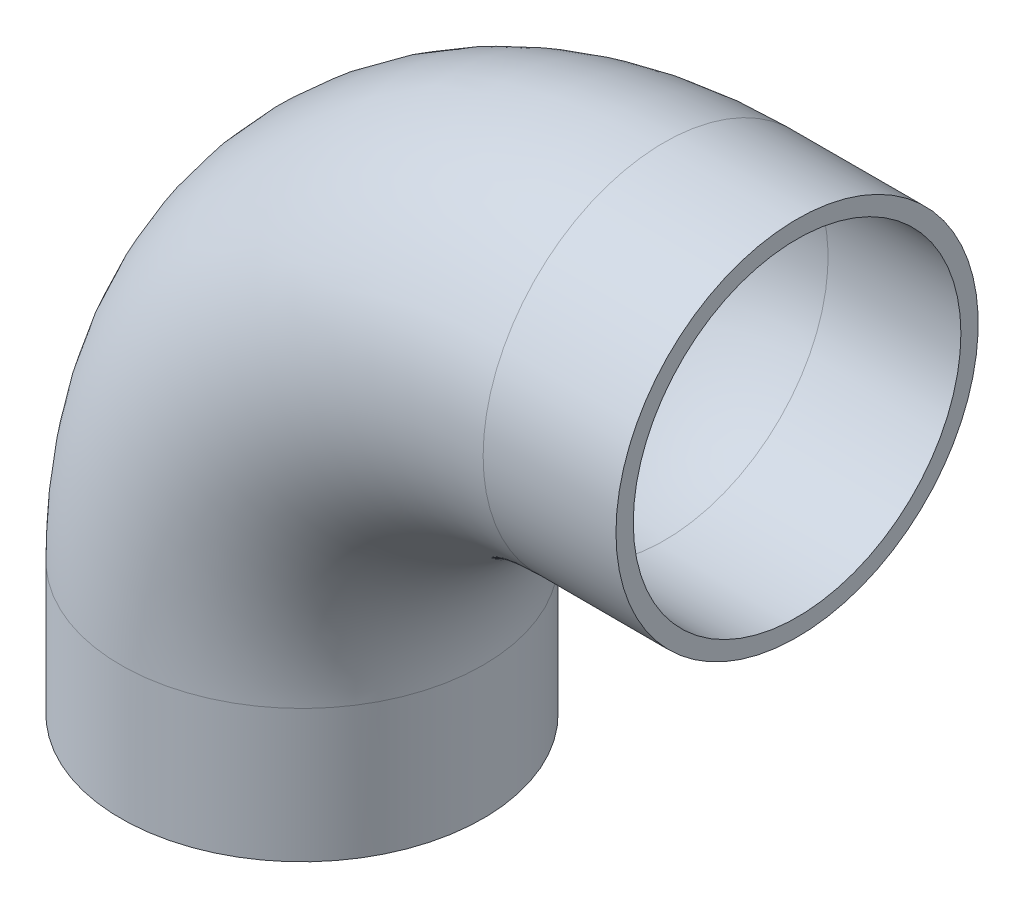
ISO-10303-21;
HEADER;
FILE_DESCRIPTION(('STEP AP214'),'2;1');
FILE_NAME('part.step','',(''),(''),'','','');
FILE_SCHEMA(('AUTOMOTIVE_DESIGN { 1 0 10303 214 1 1 1 1 }'));
ENDSEC;
DATA;
#1=APPLICATION_CONTEXT('core data for automotive mechanical design processes');
#2=APPLICATION_PROTOCOL_DEFINITION('international standard','automotive_design',2000,#1);
#3=PRODUCT_CONTEXT('',#1,'mechanical');
#4=PRODUCT('Part','Part','',(#3));
#5=PRODUCT_RELATED_PRODUCT_CATEGORY('part','',(#4));
#6=PRODUCT_DEFINITION_FORMATION('','',#4);
#7=PRODUCT_DEFINITION_CONTEXT('part definition',#1,'design');
#8=PRODUCT_DEFINITION('design','',#6,#7);
#9=PRODUCT_DEFINITION_SHAPE('','',#8);
#10=(LENGTH_UNIT() NAMED_UNIT(*) SI_UNIT(.MILLI.,.METRE.));
#11=(NAMED_UNIT(*) PLANE_ANGLE_UNIT() SI_UNIT($,.RADIAN.));
#12=(NAMED_UNIT(*) SI_UNIT($,.STERADIAN.) SOLID_ANGLE_UNIT());
#13=UNCERTAINTY_MEASURE_WITH_UNIT(LENGTH_MEASURE(1.E-05),#10,'distance_accuracy_value','');
#14=(GEOMETRIC_REPRESENTATION_CONTEXT(3) GLOBAL_UNCERTAINTY_ASSIGNED_CONTEXT((#13)) GLOBAL_UNIT_ASSIGNED_CONTEXT((#10,
#11,#12)) REPRESENTATION_CONTEXT('',''));
#15=CARTESIAN_POINT('',(0.,0.,0.));
#16=DIRECTION('',(0.,0.,1.));
#17=DIRECTION('',(1.,0.,0.));
#18=AXIS2_PLACEMENT_3D('',#15,#16,#17);
#19=CARTESIAN_POINT('',(90.,33.,0.));
#20=DIRECTION('',(0.,0.,1.));
#21=DIRECTION('',(1.,0.,0.));
#22=AXIS2_PLACEMENT_3D('',#19,#20,#21);
#23=TOROIDAL_SURFACE('',#22,90.,40.7);
#24=CARTESIAN_POINT('',(90.,123.,0.));
#25=DIRECTION('',(-1.,0.,0.));
#26=DIRECTION('',(0.,1.,0.));
#27=AXIS2_PLACEMENT_3D('',#24,#25,#26);
#28=CIRCLE('',#27,40.7);
#29=CARTESIAN_POINT('',(90.,163.7,0.));
#30=VERTEX_POINT('',#29);
#31=EDGE_CURVE('E33',#30,#30,#28,.T.);
#32=ORIENTED_EDGE('',*,*,#31,.F.);
#33=EDGE_LOOP('',(#32));
#34=FACE_BOUND('',#33,.T.);
#35=CARTESIAN_POINT('',(0.,33.,0.));
#36=DIRECTION('',(0.,-1.,0.));
#37=DIRECTION('',(-1.,0.,0.));
#38=AXIS2_PLACEMENT_3D('',#35,#36,#37);
#39=CIRCLE('',#38,40.7);
#40=CARTESIAN_POINT('',(-40.7,33.,0.));
#41=VERTEX_POINT('',#40);
#42=EDGE_CURVE('E31',#41,#41,#39,.F.);
#43=ORIENTED_EDGE('',*,*,#42,.F.);
#44=EDGE_LOOP('',(#43));
#45=FACE_BOUND('',#44,.T.);
#46=ADVANCED_FACE('F13',(#34,#45),#23,.F.);
#47=CARTESIAN_POINT('',(123.,123.,0.));
#48=DIRECTION('',(-1.,0.,0.));
#49=DIRECTION('',(0.,0.,1.));
#50=AXIS2_PLACEMENT_3D('',#47,#48,#49);
#51=CYLINDRICAL_SURFACE('',#50,40.7);
#52=CARTESIAN_POINT('',(123.,123.,0.));
#53=DIRECTION('',(-1.,0.,0.));
#54=DIRECTION('',(0.,0.,1.));
#55=AXIS2_PLACEMENT_3D('',#52,#53,#54);
#56=CIRCLE('',#55,40.7);
#57=CARTESIAN_POINT('',(123.,123.,40.7));
#58=VERTEX_POINT('',#57);
#59=EDGE_CURVE('E17',#58,#58,#56,.T.);
#60=ORIENTED_EDGE('',*,*,#59,.F.);
#61=EDGE_LOOP('',(#60));
#62=FACE_BOUND('',#61,.T.);
#63=ORIENTED_EDGE('',*,*,#31,.T.);
#64=EDGE_LOOP('',(#63));
#65=FACE_BOUND('',#64,.T.);
#66=ADVANCED_FACE('F52',(#62,#65),#51,.F.);
#67=CARTESIAN_POINT('',(0.,33.,0.));
#68=DIRECTION('',(0.,-1.,0.));
#69=DIRECTION('',(0.,0.,-1.));
#70=AXIS2_PLACEMENT_3D('',#67,#68,#69);
#71=CYLINDRICAL_SURFACE('',#70,40.7);
#72=ORIENTED_EDGE('',*,*,#42,.T.);
#73=EDGE_LOOP('',(#72));
#74=FACE_BOUND('',#73,.T.);
#75=CARTESIAN_POINT('',(0.,0.,0.));
#76=DIRECTION('',(0.,-1.,0.));
#77=DIRECTION('',(0.,0.,-1.));
#78=AXIS2_PLACEMENT_3D('',#75,#76,#77);
#79=CIRCLE('',#78,40.7);
#80=CARTESIAN_POINT('',(0.,0.,-40.7));
#81=VERTEX_POINT('',#80);
#82=EDGE_CURVE('E42',#81,#81,#79,.F.);
#83=ORIENTED_EDGE('',*,*,#82,.F.);
#84=EDGE_LOOP('',(#83));
#85=FACE_BOUND('',#84,.T.);
#86=ADVANCED_FACE('F55',(#74,#85),#71,.F.);
#87=CARTESIAN_POINT('',(123.,168.,45.5400021084901));
#88=DIRECTION('',(1.,0.,0.));
#89=DIRECTION('',(0.,-1.,0.));
#90=AXIS2_PLACEMENT_3D('',#87,#88,#89);
#91=PLANE('',#90);
#92=ORIENTED_EDGE('',*,*,#59,.T.);
#93=EDGE_LOOP('',(#92));
#94=FACE_BOUND('',#93,.T.);
#95=CARTESIAN_POINT('',(123.,123.,0.));
#96=DIRECTION('',(-1.,0.,0.));
#97=DIRECTION('',(0.,0.,1.));
#98=AXIS2_PLACEMENT_3D('',#95,#96,#97);
#99=CIRCLE('',#98,45.);
#100=CARTESIAN_POINT('',(123.,123.,45.));
#101=VERTEX_POINT('',#100);
#102=EDGE_CURVE('E40',#101,#101,#99,.T.);
#103=ORIENTED_EDGE('',*,*,#102,.F.);
#104=EDGE_LOOP('',(#103));
#105=FACE_BOUND('',#104,.T.);
#106=ADVANCED_FACE('F49',(#94,#105),#91,.T.);
#107=CARTESIAN_POINT('',(45.,0.,45.5400021084901));
#108=DIRECTION('',(0.,-1.,0.));
#109=DIRECTION('',(-1.,0.,0.));
#110=AXIS2_PLACEMENT_3D('',#107,#108,#109);
#111=PLANE('',#110);
#112=ORIENTED_EDGE('',*,*,#82,.T.);
#113=EDGE_LOOP('',(#112));
#114=FACE_BOUND('',#113,.T.);
#115=CARTESIAN_POINT('',(0.,0.,0.));
#116=DIRECTION('',(0.,-1.,0.));
#117=DIRECTION('',(0.,0.,-1.));
#118=AXIS2_PLACEMENT_3D('',#115,#116,#117);
#119=CIRCLE('',#118,45.);
#120=CARTESIAN_POINT('',(0.,0.,-45.));
#121=VERTEX_POINT('',#120);
#122=EDGE_CURVE('E26',#121,#121,#119,.F.);
#123=ORIENTED_EDGE('',*,*,#122,.F.);
#124=EDGE_LOOP('',(#123));
#125=FACE_BOUND('',#124,.T.);
#126=ADVANCED_FACE('F69',(#114,#125),#111,.T.);
#127=CARTESIAN_POINT('',(90.,123.,0.));
#128=DIRECTION('',(-1.,0.,0.));
#129=DIRECTION('',(0.,0.,1.));
#130=AXIS2_PLACEMENT_3D('',#127,#128,#129);
#131=CYLINDRICAL_SURFACE('',#130,45.);
#132=ORIENTED_EDGE('',*,*,#102,.T.);
#133=EDGE_LOOP('',(#132));
#134=FACE_BOUND('',#133,.T.);
#135=CARTESIAN_POINT('',(90.,123.,0.));
#136=DIRECTION('',(-1.,0.,0.));
#137=DIRECTION('',(0.,-1.,0.));
#138=AXIS2_PLACEMENT_3D('',#135,#136,#137);
#139=CIRCLE('',#138,45.);
#140=CARTESIAN_POINT('',(90.,78.,0.));
#141=VERTEX_POINT('',#140);
#142=EDGE_CURVE('E21',#141,#141,#139,.T.);
#143=ORIENTED_EDGE('',*,*,#142,.F.);
#144=EDGE_LOOP('',(#143));
#145=FACE_BOUND('',#144,.T.);
#146=ADVANCED_FACE('F79',(#134,#145),#131,.T.);
#147=CARTESIAN_POINT('',(0.,0.,0.));
#148=DIRECTION('',(0.,-1.,0.));
#149=DIRECTION('',(0.,0.,-1.));
#150=AXIS2_PLACEMENT_3D('',#147,#148,#149);
#151=CYLINDRICAL_SURFACE('',#150,45.);
#152=CARTESIAN_POINT('',(0.,33.,0.));
#153=DIRECTION('',(0.,-1.,0.));
#154=DIRECTION('',(1.,0.,0.));
#155=AXIS2_PLACEMENT_3D('',#152,#153,#154);
#156=CIRCLE('',#155,45.);
#157=CARTESIAN_POINT('',(45.,33.,0.));
#158=VERTEX_POINT('',#157);
#159=EDGE_CURVE('E8',#158,#158,#156,.F.);
#160=ORIENTED_EDGE('',*,*,#159,.F.);
#161=EDGE_LOOP('',(#160));
#162=FACE_BOUND('',#161,.T.);
#163=ORIENTED_EDGE('',*,*,#122,.T.);
#164=EDGE_LOOP('',(#163));
#165=FACE_BOUND('',#164,.T.);
#166=ADVANCED_FACE('F73',(#162,#165),#151,.T.);
#167=CARTESIAN_POINT('',(90.,33.,0.));
#168=DIRECTION('',(0.,0.,1.));
#169=DIRECTION('',(1.,0.,0.));
#170=AXIS2_PLACEMENT_3D('',#167,#168,#169);
#171=TOROIDAL_SURFACE('',#170,90.,45.);
#172=ORIENTED_EDGE('',*,*,#142,.T.);
#173=EDGE_LOOP('',(#172));
#174=FACE_BOUND('',#173,.T.);
#175=ORIENTED_EDGE('',*,*,#159,.T.);
#176=EDGE_LOOP('',(#175));
#177=FACE_BOUND('',#176,.T.);
#178=ADVANCED_FACE('F71',(#174,#177),#171,.T.);
#179=CLOSED_SHELL('',(#46,#66,#86,#106,#126,#146,#166,#178));
#180=MANIFOLD_SOLID_BREP('B1',#179);
#181=ADVANCED_BREP_SHAPE_REPRESENTATION('',(#18,#180),#14);
#182=SHAPE_DEFINITION_REPRESENTATION(#9,#181);
ENDSEC;
END-ISO-10303-21;
